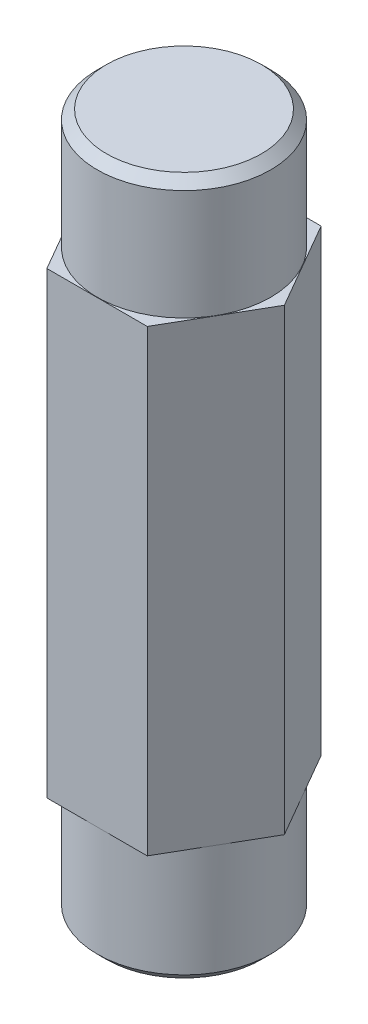
ISO-10303-21;
HEADER;
FILE_DESCRIPTION(('STEP AP214'),'2;1');
FILE_NAME('part.step','',(''),(''),'','','');
FILE_SCHEMA(('AUTOMOTIVE_DESIGN { 1 0 10303 214 1 1 1 1 }'));
ENDSEC;
DATA;
#1=APPLICATION_CONTEXT('core data for automotive mechanical design processes');
#2=APPLICATION_PROTOCOL_DEFINITION('international standard','automotive_design',2000,#1);
#3=PRODUCT_CONTEXT('',#1,'mechanical');
#4=PRODUCT('Part','Part','',(#3));
#5=PRODUCT_RELATED_PRODUCT_CATEGORY('part','',(#4));
#6=PRODUCT_DEFINITION_FORMATION('','',#4);
#7=PRODUCT_DEFINITION_CONTEXT('part definition',#1,'design');
#8=PRODUCT_DEFINITION('design','',#6,#7);
#9=PRODUCT_DEFINITION_SHAPE('','',#8);
#10=(LENGTH_UNIT() NAMED_UNIT(*) SI_UNIT(.MILLI.,.METRE.));
#11=(NAMED_UNIT(*) PLANE_ANGLE_UNIT() SI_UNIT($,.RADIAN.));
#12=(NAMED_UNIT(*) SI_UNIT($,.STERADIAN.) SOLID_ANGLE_UNIT());
#13=UNCERTAINTY_MEASURE_WITH_UNIT(LENGTH_MEASURE(1.E-05),#10,'distance_accuracy_value','');
#14=(GEOMETRIC_REPRESENTATION_CONTEXT(3) GLOBAL_UNCERTAINTY_ASSIGNED_CONTEXT((#13)) GLOBAL_UNIT_ASSIGNED_CONTEXT((#10,
#11,#12)) REPRESENTATION_CONTEXT('',''));
#15=CARTESIAN_POINT('',(0.,0.,0.));
#16=DIRECTION('',(0.,0.,1.));
#17=DIRECTION('',(1.,0.,0.));
#18=AXIS2_PLACEMENT_3D('',#15,#16,#17);
#19=CARTESIAN_POINT('',(-39.2241243202129,6.34999999999991,-16.6661167863662));
#20=DIRECTION('',(0.,-1.,0.));
#21=DIRECTION('',(1.,0.,0.));
#22=AXIS2_PLACEMENT_3D('',#19,#20,#21);
#23=PLANE('',#22);
#24=CARTESIAN_POINT('',(-39.2241243202128,6.34999999994079,-16.6661167863668));
#25=DIRECTION('',(0.,-1.,0.));
#26=DIRECTION('',(0.,0.,-1.));
#27=AXIS2_PLACEMENT_3D('',#24,#25,#26);
#28=CIRCLE('',#27,4.24180000000379);
#29=CARTESIAN_POINT('',(-39.2241243202128,6.34999999994079,-20.9079167863706));
#30=VERTEX_POINT('',#29);
#31=EDGE_CURVE('E19',#30,#30,#28,.T.);
#32=ORIENTED_EDGE('',*,*,#31,.F.);
#33=EDGE_LOOP('',(#32));
#34=FACE_BOUND('',#33,.T.);
#35=ADVANCED_FACE('F16',(#34),#23,.F.);
#36=CARTESIAN_POINT('',(-39.2241243202129,-31.8769999999992,-16.6661167863662));
#37=DIRECTION('',(0.,1.,0.));
#38=DIRECTION('',(-1.,0.,0.));
#39=AXIS2_PLACEMENT_3D('',#36,#37,#38);
#40=PLANE('',#39);
#41=CARTESIAN_POINT('',(-39.2241243202136,-31.8770000000086,-16.6661167863666));
#42=DIRECTION('',(0.,1.,0.));
#43=DIRECTION('',(0.,0.,1.));
#44=AXIS2_PLACEMENT_3D('',#41,#42,#43);
#45=CIRCLE('',#44,4.24180000002966);
#46=CARTESIAN_POINT('',(-39.2241243202136,-31.8770000000086,-12.4243167863369));
#47=VERTEX_POINT('',#46);
#48=EDGE_CURVE('E108',#47,#47,#45,.T.);
#49=ORIENTED_EDGE('',*,*,#48,.F.);
#50=EDGE_LOOP('',(#49));
#51=FACE_BOUND('',#50,.T.);
#52=ADVANCED_FACE('F122',(#51),#40,.F.);
#53=CARTESIAN_POINT('',(-39.2241243202128,5.8420000000865,-16.6661167863668));
#54=DIRECTION('',(0.,-1.,0.));
#55=DIRECTION('',(0.,0.,-1.));
#56=AXIS2_PLACEMENT_3D('',#53,#54,#55);
#57=CONICAL_SURFACE('',#56,4.74979999991493,0.785398163453397);
#58=CARTESIAN_POINT('',(-39.2241243202129,5.84199999999996,-16.6661167863662));
#59=DIRECTION('',(0.,-1.,0.));
#60=DIRECTION('',(1.,0.,0.));
#61=AXIS2_PLACEMENT_3D('',#58,#59,#60);
#62=CIRCLE('',#61,4.74980000000004);
#63=CARTESIAN_POINT('',(-34.4743243202128,5.84199999999996,-16.6661167863662));
#64=VERTEX_POINT('',#63);
#65=EDGE_CURVE('E105',#64,#64,#62,.T.);
#66=ORIENTED_EDGE('',*,*,#65,.F.);
#67=EDGE_LOOP('',(#66));
#68=FACE_BOUND('',#67,.T.);
#69=ORIENTED_EDGE('',*,*,#31,.T.);
#70=EDGE_LOOP('',(#69));
#71=FACE_BOUND('',#70,.T.);
#72=ADVANCED_FACE('F119',(#68,#71),#57,.T.);
#73=CARTESIAN_POINT('',(-39.2241243202136,-31.3690000000406,-16.6661167863666));
#74=DIRECTION('',(0.,1.,0.));
#75=DIRECTION('',(0.,0.,1.));
#76=AXIS2_PLACEMENT_3D('',#73,#74,#75);
#77=CONICAL_SURFACE('',#76,4.74980000005448,0.785398163453397);
#78=CARTESIAN_POINT('',(-39.2241243202129,-31.3689999999992,-16.6661167863662));
#79=DIRECTION('',(0.,1.,0.));
#80=DIRECTION('',(-1.,0.,0.));
#81=AXIS2_PLACEMENT_3D('',#78,#79,#80);
#82=CIRCLE('',#81,4.74980000000004);
#83=CARTESIAN_POINT('',(-43.9739243202129,-31.3689999999992,-16.6661167863662));
#84=VERTEX_POINT('',#83);
#85=EDGE_CURVE('E102',#84,#84,#82,.T.);
#86=ORIENTED_EDGE('',*,*,#85,.F.);
#87=EDGE_LOOP('',(#86));
#88=FACE_BOUND('',#87,.T.);
#89=ORIENTED_EDGE('',*,*,#48,.T.);
#90=EDGE_LOOP('',(#89));
#91=FACE_BOUND('',#90,.T.);
#92=ADVANCED_FACE('F164',(#88,#91),#77,.T.);
#93=CARTESIAN_POINT('',(-39.2241243202129,6.34999999999991,-16.6661167863662));
#94=DIRECTION('',(0.,-1.,0.));
#95=DIRECTION('',(1.,0.,0.));
#96=AXIS2_PLACEMENT_3D('',#93,#94,#95);
#97=CYLINDRICAL_SURFACE('',#96,4.74980000000004);
#98=CARTESIAN_POINT('',(-39.2241243202129,-0.203199999999237,-16.6661167863662));
#99=DIRECTION('',(0.,-1.,0.));
#100=DIRECTION('',(1.,0.,0.));
#101=AXIS2_PLACEMENT_3D('',#98,#99,#100);
#102=CIRCLE('',#101,4.74980000000004);
#103=CARTESIAN_POINT('',(-34.4743243202128,-0.203199999999237,-16.6661167863662));
#104=VERTEX_POINT('',#103);
#105=EDGE_CURVE('E79',#104,#104,#102,.T.);
#106=ORIENTED_EDGE('',*,*,#105,.F.);
#107=EDGE_LOOP('',(#106));
#108=FACE_BOUND('',#107,.T.);
#109=ORIENTED_EDGE('',*,*,#65,.T.);
#110=EDGE_LOOP('',(#109));
#111=FACE_BOUND('',#110,.T.);
#112=ADVANCED_FACE('F160',(#108,#111),#97,.T.);
#113=CARTESIAN_POINT('',(-39.2241243202129,-31.8769999999992,-16.6661167863662));
#114=DIRECTION('',(0.,1.,0.));
#115=DIRECTION('',(-1.,0.,0.));
#116=AXIS2_PLACEMENT_3D('',#113,#114,#115);
#117=CYLINDRICAL_SURFACE('',#116,4.74980000000004);
#118=CARTESIAN_POINT('',(-39.2241243202129,-25.3237999999992,-16.6661167863662));
#119=DIRECTION('',(0.,1.,0.));
#120=DIRECTION('',(-1.,0.,0.));
#121=AXIS2_PLACEMENT_3D('',#118,#119,#120);
#122=CIRCLE('',#121,4.74980000000004);
#123=CARTESIAN_POINT('',(-43.9739243202129,-25.3237999999992,-16.6661167863662));
#124=VERTEX_POINT('',#123);
#125=EDGE_CURVE('E109',#124,#124,#122,.T.);
#126=ORIENTED_EDGE('',*,*,#125,.F.);
#127=EDGE_LOOP('',(#126));
#128=FACE_BOUND('',#127,.T.);
#129=ORIENTED_EDGE('',*,*,#85,.T.);
#130=EDGE_LOOP('',(#129));
#131=FACE_BOUND('',#130,.T.);
#132=ADVANCED_FACE('F156',(#128,#131),#117,.T.);
#133=CARTESIAN_POINT('',(-41.9737549772282,-25.5269999999992,-11.9036167863662));
#134=DIRECTION('',(0.,0.,1.));
#135=DIRECTION('',(1.,0.,0.));
#136=AXIS2_PLACEMENT_3D('',#133,#134,#135);
#137=PLANE('',#136);
#138=DIRECTION('',(0.,1.,0.));
#139=VECTOR('',#138,1.);
#140=CARTESIAN_POINT('',(-41.9737549772278,-25.5269999999992,-11.9036167863665));
#141=LINE('',#140,#139);
#142=CARTESIAN_POINT('',(-41.9737549772279,-25.3237999999992,-11.9036167863661));
#143=VERTEX_POINT('',#142);
#144=CARTESIAN_POINT('',(-41.9737549772279,-0.203199999999217,-11.9036167863664));
#145=VERTEX_POINT('',#144);
#146=EDGE_CURVE('E66',#143,#145,#141,.T.);
#147=ORIENTED_EDGE('',*,*,#146,.F.);
#148=DIRECTION('',(1.,0.,0.));
#149=VECTOR('',#148,1.);
#150=CARTESIAN_POINT('',(-41.9737549772282,-25.3237999999992,-11.9036167863657));
#151=LINE('',#150,#149);
#152=CARTESIAN_POINT('',(-36.4744936631966,-25.3237999999992,-11.9036167863659));
#153=VERTEX_POINT('',#152);
#154=EDGE_CURVE('E111',#153,#143,#151,.F.);
#155=ORIENTED_EDGE('',*,*,#154,.F.);
#156=DIRECTION('',(0.,1.,0.));
#157=VECTOR('',#156,1.);
#158=CARTESIAN_POINT('',(-36.4744936631964,-25.5269999999992,-11.9036167863657));
#159=LINE('',#158,#157);
#160=CARTESIAN_POINT('',(-36.4744936631965,-0.203199999999223,-11.9036167863661));
#161=VERTEX_POINT('',#160);
#162=EDGE_CURVE('E80',#161,#153,#159,.F.);
#163=ORIENTED_EDGE('',*,*,#162,.F.);
#164=DIRECTION('',(-1.,0.,0.));
#165=VECTOR('',#164,1.);
#166=CARTESIAN_POINT('',(-44.7233856342429,-0.203199999999182,-11.9036167863664));
#167=LINE('',#166,#165);
#168=EDGE_CURVE('E87',#145,#161,#167,.F.);
#169=ORIENTED_EDGE('',*,*,#168,.F.);
#170=EDGE_LOOP('',(#147,#155,#163,#169));
#171=FACE_BOUND('',#170,.T.);
#172=ADVANCED_FACE('F153',(#171),#137,.T.);
#173=CARTESIAN_POINT('',(-44.7233856342431,-25.5269999999992,-16.6661167863659));
#174=DIRECTION('',(-0.866025403784435,0.,0.500000000000007));
#175=DIRECTION('',(0.500000000000007,0.,0.866025403784435));
#176=AXIS2_PLACEMENT_3D('',#173,#174,#175);
#177=PLANE('',#176);
#178=DIRECTION('',(0.,1.,0.));
#179=VECTOR('',#178,1.);
#180=CARTESIAN_POINT('',(-44.7233856342434,-25.5269999999992,-16.6661167863668));
#181=LINE('',#180,#179);
#182=CARTESIAN_POINT('',(-44.7233856342433,-25.3237999999992,-16.6661167863665));
#183=VERTEX_POINT('',#182);
#184=CARTESIAN_POINT('',(-44.7233856342433,-0.20319999999919,-16.6661167863667));
#185=VERTEX_POINT('',#184);
#186=EDGE_CURVE('E71',#183,#185,#181,.T.);
#187=ORIENTED_EDGE('',*,*,#186,.F.);
#188=DIRECTION('',(-0.499999999999844,0.,-0.866025403784528));
#189=VECTOR('',#188,1.);
#190=CARTESIAN_POINT('',(-41.9737549772282,-25.3237999999992,-11.9036167863662));
#191=LINE('',#190,#189);
#192=EDGE_CURVE('E271',#143,#183,#191,.T.);
#193=ORIENTED_EDGE('',*,*,#192,.F.);
#194=ORIENTED_EDGE('',*,*,#146,.T.);
#195=DIRECTION('',(0.499999999999892,0.,0.866025403784501));
#196=VECTOR('',#195,1.);
#197=CARTESIAN_POINT('',(-44.7233856342429,-0.203199999999182,-16.6661167863667));
#198=LINE('',#197,#196);
#199=EDGE_CURVE('E83',#185,#145,#198,.T.);
#200=ORIENTED_EDGE('',*,*,#199,.F.);
#201=EDGE_LOOP('',(#187,#193,#194,#200));
#202=FACE_BOUND('',#201,.T.);
#203=ADVANCED_FACE('F84',(#202),#177,.T.);
#204=CARTESIAN_POINT('',(-36.4744936631964,-25.5269999999992,-11.9036167863657));
#205=DIRECTION('',(0.866025403784434,0.,0.500000000000007));
#206=DIRECTION('',(0.500000000000007,0.,-0.866025403784434));
#207=AXIS2_PLACEMENT_3D('',#204,#205,#206);
#208=PLANE('',#207);
#209=ORIENTED_EDGE('',*,*,#162,.T.);
#210=DIRECTION('',(-0.499999999999796,0.,0.866025403784556));
#211=VECTOR('',#210,1.);
#212=CARTESIAN_POINT('',(-33.724863006182,-25.3237999999992,-16.6661167863665));
#213=LINE('',#212,#211);
#214=CARTESIAN_POINT('',(-33.7248630061817,-25.3237999999992,-16.6661167863663));
#215=VERTEX_POINT('',#214);
#216=EDGE_CURVE('E275',#215,#153,#213,.T.);
#217=ORIENTED_EDGE('',*,*,#216,.F.);
#218=DIRECTION('',(0.,1.,0.));
#219=VECTOR('',#218,1.);
#220=CARTESIAN_POINT('',(-33.7248630061821,-25.5269999999992,-16.6661167863664));
#221=LINE('',#220,#219);
#222=CARTESIAN_POINT('',(-33.7248630061815,-0.20319999999921,-16.6661167863664));
#223=VERTEX_POINT('',#222);
#224=EDGE_CURVE('E112',#223,#215,#221,.F.);
#225=ORIENTED_EDGE('',*,*,#224,.F.);
#226=DIRECTION('',(0.499999999999844,0.,-0.866025403784529));
#227=VECTOR('',#226,1.);
#228=CARTESIAN_POINT('',(-36.4744936631966,-0.203199999999182,-11.9036167863658));
#229=LINE('',#228,#227);
#230=EDGE_CURVE('E283',#161,#223,#229,.T.);
#231=ORIENTED_EDGE('',*,*,#230,.F.);
#232=EDGE_LOOP('',(#209,#217,#225,#231));
#233=FACE_BOUND('',#232,.T.);
#234=ADVANCED_FACE('F147',(#233),#208,.T.);
#235=CARTESIAN_POINT('',(-41.9737549772279,-25.5269999999992,-21.4286167863665));
#236=DIRECTION('',(-0.866025403784434,0.,-0.500000000000008));
#237=DIRECTION('',(-0.500000000000008,0.,0.866025403784434));
#238=AXIS2_PLACEMENT_3D('',#235,#236,#237);
#239=PLANE('',#238);
#240=DIRECTION('',(0.,1.,0.));
#241=VECTOR('',#240,1.);
#242=CARTESIAN_POINT('',(-41.9737549772279,-25.5269999999992,-21.428616786366));
#243=LINE('',#242,#241);
#244=CARTESIAN_POINT('',(-41.9737549772279,-25.3237999999992,-21.4286167863664));
#245=VERTEX_POINT('',#244);
#246=CARTESIAN_POINT('',(-41.9737549772279,-0.203199999999196,-21.4286167863664));
#247=VERTEX_POINT('',#246);
#248=EDGE_CURVE('E287',#245,#247,#243,.T.);
#249=ORIENTED_EDGE('',*,*,#248,.F.);
#250=DIRECTION('',(0.499999999999907,0.,-0.866025403784492));
#251=VECTOR('',#250,1.);
#252=CARTESIAN_POINT('',(-44.7233856342428,-25.3237999999992,-16.6661167863665));
#253=LINE('',#252,#251);
#254=EDGE_CURVE('E77',#183,#245,#253,.T.);
#255=ORIENTED_EDGE('',*,*,#254,.F.);
#256=ORIENTED_EDGE('',*,*,#186,.T.);
#257=DIRECTION('',(-0.499999999999923,0.,0.866025403784483));
#258=VECTOR('',#257,1.);
#259=CARTESIAN_POINT('',(-41.9737549772279,-0.203199999999182,-21.4286167863666));
#260=LINE('',#259,#258);
#261=EDGE_CURVE('E74',#247,#185,#260,.T.);
#262=ORIENTED_EDGE('',*,*,#261,.F.);
#263=EDGE_LOOP('',(#249,#255,#256,#262));
#264=FACE_BOUND('',#263,.T.);
#265=ADVANCED_FACE('F72',(#264),#239,.T.);
#266=CARTESIAN_POINT('',(-44.7233856342429,-0.203199999999182,-16.6661167863667));
#267=DIRECTION('',(0.,1.,0.));
#268=DIRECTION('',(-1.,0.,0.));
#269=AXIS2_PLACEMENT_3D('',#266,#267,#268);
#270=PLANE('',#269);
#271=DIRECTION('',(-0.500000000000007,0.,-0.866025403784435));
#272=VECTOR('',#271,1.);
#273=CARTESIAN_POINT('',(-33.724863006182,-0.203199999999237,-16.6661167863664));
#274=LINE('',#273,#272);
#275=CARTESIAN_POINT('',(-36.474493663196,-0.20319999999921,-21.4286167863661));
#276=VERTEX_POINT('',#275);
#277=EDGE_CURVE('E280',#276,#223,#274,.F.);
#278=ORIENTED_EDGE('',*,*,#277,.F.);
#279=DIRECTION('',(-1.,0.,0.));
#280=VECTOR('',#279,1.);
#281=CARTESIAN_POINT('',(-36.4744936631962,-0.203199999999237,-21.428616786366));
#282=LINE('',#281,#280);
#283=EDGE_CURVE('E92',#247,#276,#282,.F.);
#284=ORIENTED_EDGE('',*,*,#283,.F.);
#285=ORIENTED_EDGE('',*,*,#261,.T.);
#286=ORIENTED_EDGE('',*,*,#199,.T.);
#287=ORIENTED_EDGE('',*,*,#168,.T.);
#288=ORIENTED_EDGE('',*,*,#230,.T.);
#289=EDGE_LOOP('',(#278,#284,#285,#286,#287,#288));
#290=FACE_BOUND('',#289,.T.);
#291=ORIENTED_EDGE('',*,*,#105,.T.);
#292=EDGE_LOOP('',(#291));
#293=FACE_BOUND('',#292,.T.);
#294=ADVANCED_FACE('F89',(#290,#293),#270,.T.);
#295=CARTESIAN_POINT('',(-33.724863006182,-25.5269999999992,-16.6661167863664));
#296=DIRECTION('',(0.866025403784435,0.,-0.500000000000007));
#297=DIRECTION('',(-0.500000000000007,0.,-0.866025403784435));
#298=AXIS2_PLACEMENT_3D('',#295,#296,#297);
#299=PLANE('',#298);
#300=ORIENTED_EDGE('',*,*,#224,.T.);
#301=DIRECTION('',(0.499999999999843,0.,0.86602540378453));
#302=VECTOR('',#301,1.);
#303=CARTESIAN_POINT('',(-36.4744936631962,-25.3237999999992,-21.428616786366));
#304=LINE('',#303,#302);
#305=CARTESIAN_POINT('',(-36.4744936631966,-25.3237999999992,-21.4286167863659));
#306=VERTEX_POINT('',#305);
#307=EDGE_CURVE('E34',#306,#215,#304,.T.);
#308=ORIENTED_EDGE('',*,*,#307,.F.);
#309=DIRECTION('',(0.,1.,0.));
#310=VECTOR('',#309,1.);
#311=CARTESIAN_POINT('',(-36.4744936631956,-25.5269999999992,-21.428616786366));
#312=LINE('',#311,#310);
#313=EDGE_CURVE('E25',#276,#306,#312,.F.);
#314=ORIENTED_EDGE('',*,*,#313,.F.);
#315=ORIENTED_EDGE('',*,*,#277,.T.);
#316=EDGE_LOOP('',(#300,#308,#314,#315));
#317=FACE_BOUND('',#316,.T.);
#318=ADVANCED_FACE('F136',(#317),#299,.T.);
#319=CARTESIAN_POINT('',(-41.9737549772282,-25.3237999999992,-11.9036167863662));
#320=DIRECTION('',(0.,-1.,0.));
#321=DIRECTION('',(1.,0.,0.));
#322=AXIS2_PLACEMENT_3D('',#319,#320,#321);
#323=PLANE('',#322);
#324=ORIENTED_EDGE('',*,*,#307,.T.);
#325=ORIENTED_EDGE('',*,*,#216,.T.);
#326=ORIENTED_EDGE('',*,*,#154,.T.);
#327=ORIENTED_EDGE('',*,*,#192,.T.);
#328=ORIENTED_EDGE('',*,*,#254,.T.);
#329=DIRECTION('',(-1.,0.,0.));
#330=VECTOR('',#329,1.);
#331=CARTESIAN_POINT('',(-36.4744936631962,-25.3237999999992,-21.428616786366));
#332=LINE('',#331,#330);
#333=EDGE_CURVE('E11',#306,#245,#332,.T.);
#334=ORIENTED_EDGE('',*,*,#333,.F.);
#335=EDGE_LOOP('',(#324,#325,#326,#327,#328,#334));
#336=FACE_BOUND('',#335,.T.);
#337=ORIENTED_EDGE('',*,*,#125,.T.);
#338=EDGE_LOOP('',(#337));
#339=FACE_BOUND('',#338,.T.);
#340=ADVANCED_FACE('F130',(#336,#339),#323,.T.);
#341=CARTESIAN_POINT('',(-36.4744936631962,-25.5269999999992,-21.428616786366));
#342=DIRECTION('',(0.,0.,-1.));
#343=DIRECTION('',(-1.,0.,0.));
#344=AXIS2_PLACEMENT_3D('',#341,#342,#343);
#345=PLANE('',#344);
#346=ORIENTED_EDGE('',*,*,#313,.T.);
#347=ORIENTED_EDGE('',*,*,#333,.T.);
#348=ORIENTED_EDGE('',*,*,#248,.T.);
#349=ORIENTED_EDGE('',*,*,#283,.T.);
#350=EDGE_LOOP('',(#346,#347,#348,#349));
#351=FACE_BOUND('',#350,.T.);
#352=ADVANCED_FACE('F128',(#351),#345,.T.);
#353=CLOSED_SHELL('',(#35,#52,#72,#92,#112,#132,#172,#203,#234,#265,#294,#318,#340,#352));
#354=MANIFOLD_SOLID_BREP('B1',#353);
#355=ADVANCED_BREP_SHAPE_REPRESENTATION('',(#18,#354),#14);
#356=SHAPE_DEFINITION_REPRESENTATION(#9,#355);
ENDSEC;
END-ISO-10303-21;
